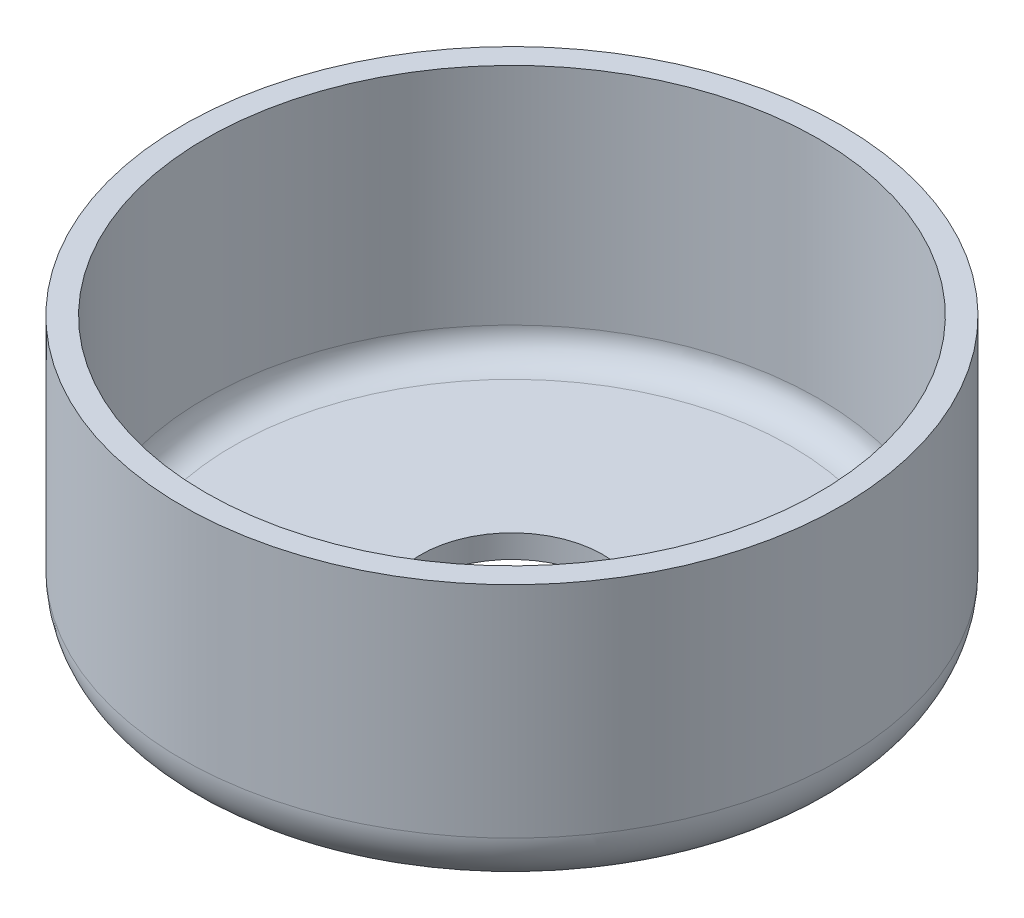
ISO-10303-21;
HEADER;
FILE_DESCRIPTION(('STEP AP214'),'2;1');
FILE_NAME('part.step','',(''),(''),'','','');
FILE_SCHEMA(('AUTOMOTIVE_DESIGN { 1 0 10303 214 1 1 1 1 }'));
ENDSEC;
DATA;
#1=APPLICATION_CONTEXT('core data for automotive mechanical design processes');
#2=APPLICATION_PROTOCOL_DEFINITION('international standard','automotive_design',2000,#1);
#3=PRODUCT_CONTEXT('',#1,'mechanical');
#4=PRODUCT('Part','Part','',(#3));
#5=PRODUCT_RELATED_PRODUCT_CATEGORY('part','',(#4));
#6=PRODUCT_DEFINITION_FORMATION('','',#4);
#7=PRODUCT_DEFINITION_CONTEXT('part definition',#1,'design');
#8=PRODUCT_DEFINITION('design','',#6,#7);
#9=PRODUCT_DEFINITION_SHAPE('','',#8);
#10=(LENGTH_UNIT() NAMED_UNIT(*) SI_UNIT(.MILLI.,.METRE.));
#11=(NAMED_UNIT(*) PLANE_ANGLE_UNIT() SI_UNIT($,.RADIAN.));
#12=(NAMED_UNIT(*) SI_UNIT($,.STERADIAN.) SOLID_ANGLE_UNIT());
#13=UNCERTAINTY_MEASURE_WITH_UNIT(LENGTH_MEASURE(1.E-05),#10,'distance_accuracy_value','');
#14=(GEOMETRIC_REPRESENTATION_CONTEXT(3) GLOBAL_UNCERTAINTY_ASSIGNED_CONTEXT((#13)) GLOBAL_UNIT_ASSIGNED_CONTEXT((#10,
#11,#12)) REPRESENTATION_CONTEXT('',''));
#15=CARTESIAN_POINT('',(0.,0.,0.));
#16=DIRECTION('',(0.,0.,1.));
#17=DIRECTION('',(1.,0.,0.));
#18=AXIS2_PLACEMENT_3D('',#15,#16,#17);
#19=CARTESIAN_POINT('',(0.,0.,0.));
#20=DIRECTION('',(0.,-1.,0.));
#21=DIRECTION('',(0.,0.,-1.));
#22=AXIS2_PLACEMENT_3D('',#19,#20,#21);
#23=CYLINDRICAL_SURFACE('',#22,3.302);
#24=CARTESIAN_POINT('',(0.,0.,0.));
#25=DIRECTION('',(0.,-1.,0.));
#26=DIRECTION('',(0.,0.,-1.));
#27=AXIS2_PLACEMENT_3D('',#24,#25,#26);
#28=CIRCLE('',#27,3.302);
#29=CARTESIAN_POINT('',(0.,0.,-3.302));
#30=VERTEX_POINT('',#29);
#31=EDGE_CURVE('E12',#30,#30,#28,.T.);
#32=ORIENTED_EDGE('',*,*,#31,.T.);
#33=EDGE_LOOP('',(#32));
#34=FACE_BOUND('',#33,.T.);
#35=CARTESIAN_POINT('',(0.,0.8382,0.));
#36=DIRECTION('',(0.,-1.,0.));
#37=DIRECTION('',(0.,0.,-1.));
#38=AXIS2_PLACEMENT_3D('',#35,#36,#37);
#39=CIRCLE('',#38,3.302);
#40=CARTESIAN_POINT('',(0.,0.8382,-3.302));
#41=VERTEX_POINT('',#40);
#42=EDGE_CURVE('E69',#41,#41,#39,.T.);
#43=ORIENTED_EDGE('',*,*,#42,.F.);
#44=EDGE_LOOP('',(#43));
#45=FACE_BOUND('',#44,.T.);
#46=ADVANCED_FACE('F41',(#34,#45),#23,.F.);
#47=CARTESIAN_POINT('',(3.302,0.,0.));
#48=DIRECTION('',(0.,-1.,0.));
#49=DIRECTION('',(0.,0.,-1.));
#50=AXIS2_PLACEMENT_3D('',#47,#48,#49);
#51=PLANE('',#50);
#52=CARTESIAN_POINT('',(0.,0.,0.));
#53=DIRECTION('',(0.,-1.,0.));
#54=DIRECTION('',(0.,0.,-1.));
#55=AXIS2_PLACEMENT_3D('',#52,#53,#54);
#56=CIRCLE('',#55,9.9314);
#57=CARTESIAN_POINT('',(0.,0.,-9.9314));
#58=VERTEX_POINT('',#57);
#59=EDGE_CURVE('E47',#58,#58,#56,.T.);
#60=ORIENTED_EDGE('',*,*,#59,.T.);
#61=EDGE_LOOP('',(#60));
#62=FACE_BOUND('',#61,.T.);
#63=ORIENTED_EDGE('',*,*,#31,.F.);
#64=EDGE_LOOP('',(#63));
#65=FACE_BOUND('',#64,.T.);
#66=ADVANCED_FACE('F77',(#62,#65),#51,.T.);
#67=CARTESIAN_POINT('',(0.,2.032,0.));
#68=DIRECTION('',(0.,-1.,0.));
#69=DIRECTION('',(0.,0.,-1.));
#70=AXIS2_PLACEMENT_3D('',#67,#68,#69);
#71=TOROIDAL_SURFACE('',#70,9.9314,2.032);
#72=CARTESIAN_POINT('',(0.,2.032,0.));
#73=DIRECTION('',(0.,-1.,0.));
#74=DIRECTION('',(0.,0.,-1.));
#75=AXIS2_PLACEMENT_3D('',#72,#73,#74);
#76=CIRCLE('',#75,11.9634);
#77=CARTESIAN_POINT('',(0.,2.032,-11.9634));
#78=VERTEX_POINT('',#77);
#79=EDGE_CURVE('E51',#78,#78,#76,.T.);
#80=ORIENTED_EDGE('',*,*,#79,.T.);
#81=EDGE_LOOP('',(#80));
#82=FACE_BOUND('',#81,.T.);
#83=ORIENTED_EDGE('',*,*,#59,.F.);
#84=EDGE_LOOP('',(#83));
#85=FACE_BOUND('',#84,.T.);
#86=ADVANCED_FACE('F81',(#82,#85),#71,.T.);
#87=CARTESIAN_POINT('',(0.,0.,0.));
#88=DIRECTION('',(0.,-1.,0.));
#89=DIRECTION('',(0.,0.,-1.));
#90=AXIS2_PLACEMENT_3D('',#87,#88,#89);
#91=CYLINDRICAL_SURFACE('',#90,11.9634);
#92=CARTESIAN_POINT('',(0.,10.,0.));
#93=DIRECTION('',(0.,-1.,0.));
#94=DIRECTION('',(0.,0.,-1.));
#95=AXIS2_PLACEMENT_3D('',#92,#93,#94);
#96=CIRCLE('',#95,11.9634);
#97=CARTESIAN_POINT('',(0.,10.,-11.9634));
#98=VERTEX_POINT('',#97);
#99=EDGE_CURVE('E55',#98,#98,#96,.T.);
#100=ORIENTED_EDGE('',*,*,#99,.T.);
#101=EDGE_LOOP('',(#100));
#102=FACE_BOUND('',#101,.T.);
#103=ORIENTED_EDGE('',*,*,#79,.F.);
#104=EDGE_LOOP('',(#103));
#105=FACE_BOUND('',#104,.T.);
#106=ADVANCED_FACE('F85',(#102,#105),#91,.T.);
#107=CARTESIAN_POINT('',(11.1252,10.,0.));
#108=DIRECTION('',(0.,1.,0.));
#109=DIRECTION('',(0.,0.,1.));
#110=AXIS2_PLACEMENT_3D('',#107,#108,#109);
#111=PLANE('',#110);
#112=CARTESIAN_POINT('',(0.,10.,0.));
#113=DIRECTION('',(0.,-1.,0.));
#114=DIRECTION('',(0.,0.,-1.));
#115=AXIS2_PLACEMENT_3D('',#112,#113,#114);
#116=CIRCLE('',#115,11.1252);
#117=CARTESIAN_POINT('',(0.,10.,-11.1252));
#118=VERTEX_POINT('',#117);
#119=EDGE_CURVE('E60',#118,#118,#116,.T.);
#120=ORIENTED_EDGE('',*,*,#119,.T.);
#121=EDGE_LOOP('',(#120));
#122=FACE_BOUND('',#121,.T.);
#123=ORIENTED_EDGE('',*,*,#99,.F.);
#124=EDGE_LOOP('',(#123));
#125=FACE_BOUND('',#124,.T.);
#126=ADVANCED_FACE('F92',(#122,#125),#111,.T.);
#127=CARTESIAN_POINT('',(0.,0.,0.));
#128=DIRECTION('',(0.,-1.,0.));
#129=DIRECTION('',(0.,0.,-1.));
#130=AXIS2_PLACEMENT_3D('',#127,#128,#129);
#131=CYLINDRICAL_SURFACE('',#130,11.1252);
#132=CARTESIAN_POINT('',(0.,1.8382,0.));
#133=DIRECTION('',(0.,-1.,0.));
#134=DIRECTION('',(0.,0.,-1.));
#135=AXIS2_PLACEMENT_3D('',#132,#133,#134);
#136=CIRCLE('',#135,11.1252);
#137=CARTESIAN_POINT('',(0.,1.8382,-11.1252));
#138=VERTEX_POINT('',#137);
#139=EDGE_CURVE('E63',#138,#138,#136,.T.);
#140=ORIENTED_EDGE('',*,*,#139,.T.);
#141=EDGE_LOOP('',(#140));
#142=FACE_BOUND('',#141,.T.);
#143=ORIENTED_EDGE('',*,*,#119,.F.);
#144=EDGE_LOOP('',(#143));
#145=FACE_BOUND('',#144,.T.);
#146=ADVANCED_FACE('F96',(#142,#145),#131,.F.);
#147=CARTESIAN_POINT('',(0.,1.8382,0.));
#148=DIRECTION('',(0.,-1.,0.));
#149=DIRECTION('',(0.,0.,-1.));
#150=AXIS2_PLACEMENT_3D('',#147,#148,#149);
#151=TOROIDAL_SURFACE('',#150,10.1252,1.);
#152=CARTESIAN_POINT('',(0.,0.8382,0.));
#153=DIRECTION('',(0.,-1.,0.));
#154=DIRECTION('',(0.,0.,-1.));
#155=AXIS2_PLACEMENT_3D('',#152,#153,#154);
#156=CIRCLE('',#155,10.1252);
#157=CARTESIAN_POINT('',(0.,0.8382,-10.1252));
#158=VERTEX_POINT('',#157);
#159=EDGE_CURVE('E66',#158,#158,#156,.T.);
#160=ORIENTED_EDGE('',*,*,#159,.T.);
#161=EDGE_LOOP('',(#160));
#162=FACE_BOUND('',#161,.T.);
#163=ORIENTED_EDGE('',*,*,#139,.F.);
#164=EDGE_LOOP('',(#163));
#165=FACE_BOUND('',#164,.T.);
#166=ADVANCED_FACE('F100',(#162,#165),#151,.F.);
#167=CARTESIAN_POINT('',(3.302,0.8382,0.));
#168=DIRECTION('',(0.,1.,0.));
#169=DIRECTION('',(0.,0.,1.));
#170=AXIS2_PLACEMENT_3D('',#167,#168,#169);
#171=PLANE('',#170);
#172=ORIENTED_EDGE('',*,*,#42,.T.);
#173=EDGE_LOOP('',(#172));
#174=FACE_BOUND('',#173,.T.);
#175=ORIENTED_EDGE('',*,*,#159,.F.);
#176=EDGE_LOOP('',(#175));
#177=FACE_BOUND('',#176,.T.);
#178=ADVANCED_FACE('F73',(#174,#177),#171,.T.);
#179=CLOSED_SHELL('',(#46,#66,#86,#106,#126,#146,#166,#178));
#180=MANIFOLD_SOLID_BREP('B2',#179);
#181=ADVANCED_BREP_SHAPE_REPRESENTATION('',(#18,#180),#14);
#182=SHAPE_DEFINITION_REPRESENTATION(#9,#181);
ENDSEC;
END-ISO-10303-21;
